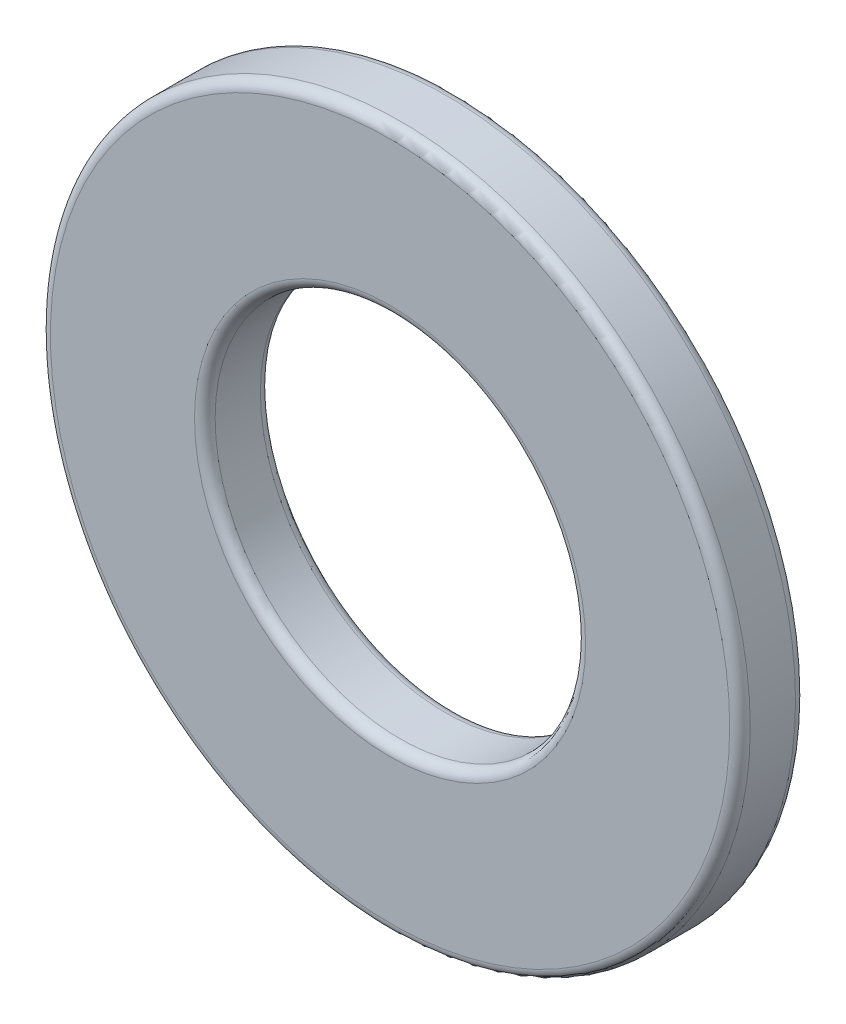
ISO-10303-21;
HEADER;
FILE_DESCRIPTION(('STEP AP214'),'2;1');
FILE_NAME('part.step','',(''),(''),'','','');
FILE_SCHEMA(('AUTOMOTIVE_DESIGN { 1 0 10303 214 1 1 1 1 }'));
ENDSEC;
DATA;
#1=APPLICATION_CONTEXT('core data for automotive mechanical design processes');
#2=APPLICATION_PROTOCOL_DEFINITION('international standard','automotive_design',2000,#1);
#3=PRODUCT_CONTEXT('',#1,'mechanical');
#4=PRODUCT('Part','Part','',(#3));
#5=PRODUCT_RELATED_PRODUCT_CATEGORY('part','',(#4));
#6=PRODUCT_DEFINITION_FORMATION('','',#4);
#7=PRODUCT_DEFINITION_CONTEXT('part definition',#1,'design');
#8=PRODUCT_DEFINITION('design','',#6,#7);
#9=PRODUCT_DEFINITION_SHAPE('','',#8);
#10=(LENGTH_UNIT() NAMED_UNIT(*) SI_UNIT(.MILLI.,.METRE.));
#11=(NAMED_UNIT(*) PLANE_ANGLE_UNIT() SI_UNIT($,.RADIAN.));
#12=(NAMED_UNIT(*) SI_UNIT($,.STERADIAN.) SOLID_ANGLE_UNIT());
#13=UNCERTAINTY_MEASURE_WITH_UNIT(LENGTH_MEASURE(1.E-05),#10,'distance_accuracy_value','');
#14=(GEOMETRIC_REPRESENTATION_CONTEXT(3) GLOBAL_UNCERTAINTY_ASSIGNED_CONTEXT((#13)) GLOBAL_UNIT_ASSIGNED_CONTEXT((#10,
#11,#12)) REPRESENTATION_CONTEXT('',''));
#15=CARTESIAN_POINT('',(0.,0.,0.));
#16=DIRECTION('',(0.,0.,1.));
#17=DIRECTION('',(1.,0.,0.));
#18=AXIS2_PLACEMENT_3D('',#15,#16,#17);
#19=CARTESIAN_POINT('',(0.,0.,1.6));
#20=DIRECTION('',(0.,0.,1.));
#21=DIRECTION('',(1.,0.,0.));
#22=AXIS2_PLACEMENT_3D('',#19,#20,#21);
#23=PLANE('',#22);
#24=CARTESIAN_POINT('',(0.,0.,1.6));
#25=DIRECTION('',(0.,0.,1.));
#26=DIRECTION('',(1.,0.,0.));
#27=AXIS2_PLACEMENT_3D('',#24,#25,#26);
#28=CIRCLE('',#27,4.75);
#29=CARTESIAN_POINT('',(4.75,0.,1.6));
#30=VERTEX_POINT('',#29);
#31=EDGE_CURVE('E50',#30,#30,#28,.F.);
#32=ORIENTED_EDGE('',*,*,#31,.T.);
#33=EDGE_LOOP('',(#32));
#34=FACE_BOUND('',#33,.T.);
#35=CARTESIAN_POINT('',(0.,0.,1.6));
#36=DIRECTION('',(0.,0.,1.));
#37=DIRECTION('',(1.,0.,0.));
#38=AXIS2_PLACEMENT_3D('',#35,#36,#37);
#39=CIRCLE('',#38,8.25);
#40=CARTESIAN_POINT('',(8.25,0.,1.6));
#41=VERTEX_POINT('',#40);
#42=EDGE_CURVE('E53',#41,#41,#39,.T.);
#43=ORIENTED_EDGE('',*,*,#42,.T.);
#44=EDGE_LOOP('',(#43));
#45=FACE_BOUND('',#44,.T.);
#46=ADVANCED_FACE('F30',(#34,#45),#23,.T.);
#47=CARTESIAN_POINT('',(0.,0.,0.));
#48=DIRECTION('',(0.,0.,1.));
#49=DIRECTION('',(1.,0.,0.));
#50=AXIS2_PLACEMENT_3D('',#47,#48,#49);
#51=PLANE('',#50);
#52=CARTESIAN_POINT('',(0.,0.,0.));
#53=DIRECTION('',(0.,0.,1.));
#54=DIRECTION('',(1.,0.,0.));
#55=AXIS2_PLACEMENT_3D('',#52,#53,#54);
#56=CIRCLE('',#55,4.75);
#57=CARTESIAN_POINT('',(4.75,0.,0.));
#58=VERTEX_POINT('',#57);
#59=EDGE_CURVE('E10',#58,#58,#56,.T.);
#60=ORIENTED_EDGE('',*,*,#59,.T.);
#61=EDGE_LOOP('',(#60));
#62=FACE_BOUND('',#61,.T.);
#63=CARTESIAN_POINT('',(0.,0.,0.));
#64=DIRECTION('',(0.,0.,1.));
#65=DIRECTION('',(1.,0.,0.));
#66=AXIS2_PLACEMENT_3D('',#63,#64,#65);
#67=CIRCLE('',#66,8.25);
#68=CARTESIAN_POINT('',(8.25,0.,0.));
#69=VERTEX_POINT('',#68);
#70=EDGE_CURVE('E37',#69,#69,#67,.F.);
#71=ORIENTED_EDGE('',*,*,#70,.T.);
#72=EDGE_LOOP('',(#71));
#73=FACE_BOUND('',#72,.T.);
#74=ADVANCED_FACE('F78',(#62,#73),#51,.F.);
#75=CARTESIAN_POINT('',(0.,0.,1.6));
#76=DIRECTION('',(0.,0.,-1.));
#77=DIRECTION('',(-1.,0.,0.));
#78=AXIS2_PLACEMENT_3D('',#75,#76,#77);
#79=CYLINDRICAL_SURFACE('',#78,8.5);
#80=CARTESIAN_POINT('',(0.,0.,1.35));
#81=DIRECTION('',(0.,0.,1.));
#82=DIRECTION('',(1.,0.,0.));
#83=AXIS2_PLACEMENT_3D('',#80,#81,#82);
#84=CIRCLE('',#83,8.5);
#85=CARTESIAN_POINT('',(8.5,0.,1.35));
#86=VERTEX_POINT('',#85);
#87=EDGE_CURVE('E41',#86,#86,#84,.F.);
#88=ORIENTED_EDGE('',*,*,#87,.T.);
#89=EDGE_LOOP('',(#88));
#90=FACE_BOUND('',#89,.T.);
#91=CARTESIAN_POINT('',(0.,0.,0.25));
#92=DIRECTION('',(0.,0.,1.));
#93=DIRECTION('',(1.,0.,0.));
#94=AXIS2_PLACEMENT_3D('',#91,#92,#93);
#95=CIRCLE('',#94,8.5);
#96=CARTESIAN_POINT('',(8.5,0.,0.25));
#97=VERTEX_POINT('',#96);
#98=EDGE_CURVE('E45',#97,#97,#95,.T.);
#99=ORIENTED_EDGE('',*,*,#98,.T.);
#100=EDGE_LOOP('',(#99));
#101=FACE_BOUND('',#100,.T.);
#102=ADVANCED_FACE('F84',(#90,#101),#79,.T.);
#103=CARTESIAN_POINT('',(0.,0.,1.6));
#104=DIRECTION('',(0.,0.,-1.));
#105=DIRECTION('',(-1.,0.,0.));
#106=AXIS2_PLACEMENT_3D('',#103,#104,#105);
#107=CYLINDRICAL_SURFACE('',#106,4.5);
#108=CARTESIAN_POINT('',(0.,0.,1.35));
#109=DIRECTION('',(0.,0.,1.));
#110=DIRECTION('',(1.,0.,0.));
#111=AXIS2_PLACEMENT_3D('',#108,#109,#110);
#112=CIRCLE('',#111,4.5);
#113=CARTESIAN_POINT('',(4.5,0.,1.35));
#114=VERTEX_POINT('',#113);
#115=EDGE_CURVE('E56',#114,#114,#112,.T.);
#116=ORIENTED_EDGE('',*,*,#115,.T.);
#117=EDGE_LOOP('',(#116));
#118=FACE_BOUND('',#117,.T.);
#119=CARTESIAN_POINT('',(0.,0.,0.25));
#120=DIRECTION('',(0.,0.,1.));
#121=DIRECTION('',(1.,0.,0.));
#122=AXIS2_PLACEMENT_3D('',#119,#120,#121);
#123=CIRCLE('',#122,4.5);
#124=CARTESIAN_POINT('',(4.5,0.,0.25));
#125=VERTEX_POINT('',#124);
#126=EDGE_CURVE('E59',#125,#125,#123,.F.);
#127=ORIENTED_EDGE('',*,*,#126,.T.);
#128=EDGE_LOOP('',(#127));
#129=FACE_BOUND('',#128,.T.);
#130=ADVANCED_FACE('F63',(#118,#129),#107,.F.);
#131=CARTESIAN_POINT('',(0.,0.,1.35));
#132=DIRECTION('',(0.,0.,1.));
#133=DIRECTION('',(1.,0.,0.));
#134=AXIS2_PLACEMENT_3D('',#131,#132,#133);
#135=TOROIDAL_SURFACE('',#134,4.75,0.25);
#136=ORIENTED_EDGE('',*,*,#31,.F.);
#137=EDGE_LOOP('',(#136));
#138=FACE_BOUND('',#137,.T.);
#139=ORIENTED_EDGE('',*,*,#115,.F.);
#140=EDGE_LOOP('',(#139));
#141=FACE_BOUND('',#140,.T.);
#142=ADVANCED_FACE('F74',(#138,#141),#135,.T.);
#143=CARTESIAN_POINT('',(0.,0.,1.35));
#144=DIRECTION('',(0.,0.,1.));
#145=DIRECTION('',(1.,0.,0.));
#146=AXIS2_PLACEMENT_3D('',#143,#144,#145);
#147=TOROIDAL_SURFACE('',#146,8.25,0.25);
#148=ORIENTED_EDGE('',*,*,#87,.F.);
#149=EDGE_LOOP('',(#148));
#150=FACE_BOUND('',#149,.T.);
#151=ORIENTED_EDGE('',*,*,#42,.F.);
#152=EDGE_LOOP('',(#151));
#153=FACE_BOUND('',#152,.T.);
#154=ADVANCED_FACE('F68',(#150,#153),#147,.T.);
#155=CARTESIAN_POINT('',(0.,0.,0.25));
#156=DIRECTION('',(0.,0.,1.));
#157=DIRECTION('',(1.,0.,0.));
#158=AXIS2_PLACEMENT_3D('',#155,#156,#157);
#159=TOROIDAL_SURFACE('',#158,4.75,0.25);
#160=ORIENTED_EDGE('',*,*,#126,.F.);
#161=EDGE_LOOP('',(#160));
#162=FACE_BOUND('',#161,.T.);
#163=ORIENTED_EDGE('',*,*,#59,.F.);
#164=EDGE_LOOP('',(#163));
#165=FACE_BOUND('',#164,.T.);
#166=ADVANCED_FACE('F65',(#162,#165),#159,.T.);
#167=CARTESIAN_POINT('',(0.,0.,0.25));
#168=DIRECTION('',(0.,0.,1.));
#169=DIRECTION('',(1.,0.,0.));
#170=AXIS2_PLACEMENT_3D('',#167,#168,#169);
#171=TOROIDAL_SURFACE('',#170,8.25,0.25);
#172=ORIENTED_EDGE('',*,*,#70,.F.);
#173=EDGE_LOOP('',(#172));
#174=FACE_BOUND('',#173,.T.);
#175=ORIENTED_EDGE('',*,*,#98,.F.);
#176=EDGE_LOOP('',(#175));
#177=FACE_BOUND('',#176,.T.);
#178=ADVANCED_FACE('F32',(#174,#177),#171,.T.);
#179=CLOSED_SHELL('',(#46,#74,#102,#130,#142,#154,#166,#178));
#180=MANIFOLD_SOLID_BREP('B2',#179);
#181=ADVANCED_BREP_SHAPE_REPRESENTATION('',(#18,#180),#14);
#182=SHAPE_DEFINITION_REPRESENTATION(#9,#181);
ENDSEC;
END-ISO-10303-21;
